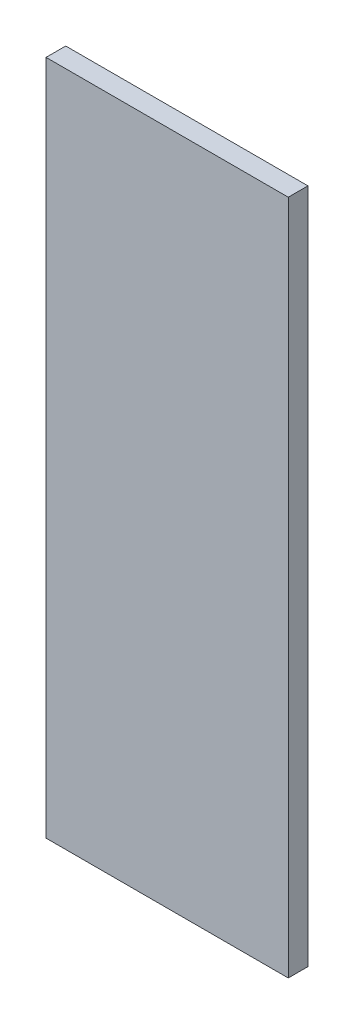
ISO-10303-21;
HEADER;
FILE_DESCRIPTION(('STEP AP214'),'2;1');
FILE_NAME('part.step','',(''),(''),'','','');
FILE_SCHEMA(('AUTOMOTIVE_DESIGN { 1 0 10303 214 1 1 1 1 }'));
ENDSEC;
DATA;
#1=APPLICATION_CONTEXT('core data for automotive mechanical design processes');
#2=APPLICATION_PROTOCOL_DEFINITION('international standard','automotive_design',2000,#1);
#3=PRODUCT_CONTEXT('',#1,'mechanical');
#4=PRODUCT('Part','Part','',(#3));
#5=PRODUCT_RELATED_PRODUCT_CATEGORY('part','',(#4));
#6=PRODUCT_DEFINITION_FORMATION('','',#4);
#7=PRODUCT_DEFINITION_CONTEXT('part definition',#1,'design');
#8=PRODUCT_DEFINITION('design','',#6,#7);
#9=PRODUCT_DEFINITION_SHAPE('','',#8);
#10=(LENGTH_UNIT() NAMED_UNIT(*) SI_UNIT(.MILLI.,.METRE.));
#11=(NAMED_UNIT(*) PLANE_ANGLE_UNIT() SI_UNIT($,.RADIAN.));
#12=(NAMED_UNIT(*) SI_UNIT($,.STERADIAN.) SOLID_ANGLE_UNIT());
#13=UNCERTAINTY_MEASURE_WITH_UNIT(LENGTH_MEASURE(1.E-05),#10,'distance_accuracy_value','');
#14=(GEOMETRIC_REPRESENTATION_CONTEXT(3) GLOBAL_UNCERTAINTY_ASSIGNED_CONTEXT((#13)) GLOBAL_UNIT_ASSIGNED_CONTEXT((#10,
#11,#12)) REPRESENTATION_CONTEXT('',''));
#15=CARTESIAN_POINT('',(0.,0.,0.));
#16=DIRECTION('',(0.,0.,1.));
#17=DIRECTION('',(1.,0.,0.));
#18=AXIS2_PLACEMENT_3D('',#15,#16,#17);
#19=CARTESIAN_POINT('',(-98.5,275.,16.));
#20=DIRECTION('',(0.,1.,0.));
#21=DIRECTION('',(0.,0.,1.));
#22=AXIS2_PLACEMENT_3D('',#19,#20,#21);
#23=PLANE('',#22);
#24=DIRECTION('',(1.,0.,0.));
#25=VECTOR('',#24,1.);
#26=CARTESIAN_POINT('',(-98.5,275.,0.));
#27=LINE('',#26,#25);
#28=CARTESIAN_POINT('',(-98.5,275.,0.));
#29=VERTEX_POINT('',#28);
#30=CARTESIAN_POINT('',(98.5,275.,0.));
#31=VERTEX_POINT('',#30);
#32=EDGE_CURVE('E110',#29,#31,#27,.T.);
#33=ORIENTED_EDGE('',*,*,#32,.F.);
#34=DIRECTION('',(0.,0.,-1.));
#35=VECTOR('',#34,1.);
#36=CARTESIAN_POINT('',(-98.5,275.,16.));
#37=LINE('',#36,#35);
#38=CARTESIAN_POINT('',(-98.5,275.,16.));
#39=VERTEX_POINT('',#38);
#40=EDGE_CURVE('E11',#39,#29,#37,.T.);
#41=ORIENTED_EDGE('',*,*,#40,.F.);
#42=DIRECTION('',(1.,0.,0.));
#43=VECTOR('',#42,1.);
#44=CARTESIAN_POINT('',(-98.5,275.,16.));
#45=LINE('',#44,#43);
#46=CARTESIAN_POINT('',(98.5,275.,16.));
#47=VERTEX_POINT('',#46);
#48=EDGE_CURVE('E103',#39,#47,#45,.T.);
#49=ORIENTED_EDGE('',*,*,#48,.T.);
#50=DIRECTION('',(0.,0.,-1.));
#51=VECTOR('',#50,1.);
#52=CARTESIAN_POINT('',(98.5,275.,16.));
#53=LINE('',#52,#51);
#54=EDGE_CURVE('E42',#47,#31,#53,.T.);
#55=ORIENTED_EDGE('',*,*,#54,.T.);
#56=EDGE_LOOP('',(#33,#41,#49,#55));
#57=FACE_BOUND('',#56,.T.);
#58=ADVANCED_FACE('F39',(#57),#23,.T.);
#59=CARTESIAN_POINT('',(-98.5,275.,16.));
#60=DIRECTION('',(1.,0.,0.));
#61=DIRECTION('',(0.,1.,0.));
#62=AXIS2_PLACEMENT_3D('',#59,#60,#61);
#63=PLANE('',#62);
#64=DIRECTION('',(0.,-1.,0.));
#65=VECTOR('',#64,1.);
#66=CARTESIAN_POINT('',(-98.5,275.,0.));
#67=LINE('',#66,#65);
#68=CARTESIAN_POINT('',(-98.5,-275.,0.));
#69=VERTEX_POINT('',#68);
#70=EDGE_CURVE('E73',#29,#69,#67,.T.);
#71=ORIENTED_EDGE('',*,*,#70,.T.);
#72=DIRECTION('',(0.,0.,-1.));
#73=VECTOR('',#72,1.);
#74=CARTESIAN_POINT('',(-98.5,-275.,16.));
#75=LINE('',#74,#73);
#76=CARTESIAN_POINT('',(-98.5,-275.,16.));
#77=VERTEX_POINT('',#76);
#78=EDGE_CURVE('E49',#77,#69,#75,.T.);
#79=ORIENTED_EDGE('',*,*,#78,.F.);
#80=DIRECTION('',(0.,-1.,0.));
#81=VECTOR('',#80,1.);
#82=CARTESIAN_POINT('',(-98.5,275.,16.));
#83=LINE('',#82,#81);
#84=EDGE_CURVE('E90',#39,#77,#83,.T.);
#85=ORIENTED_EDGE('',*,*,#84,.F.);
#86=ORIENTED_EDGE('',*,*,#40,.T.);
#87=EDGE_LOOP('',(#71,#79,#85,#86));
#88=FACE_BOUND('',#87,.T.);
#89=ADVANCED_FACE('F126',(#88),#63,.F.);
#90=CARTESIAN_POINT('',(-98.5,-275.,16.));
#91=DIRECTION('',(0.,1.,0.));
#92=DIRECTION('',(0.,0.,1.));
#93=AXIS2_PLACEMENT_3D('',#90,#91,#92);
#94=PLANE('',#93);
#95=DIRECTION('',(1.,0.,0.));
#96=VECTOR('',#95,1.);
#97=CARTESIAN_POINT('',(-98.5,-275.,0.));
#98=LINE('',#97,#96);
#99=CARTESIAN_POINT('',(98.5,-275.,0.));
#100=VERTEX_POINT('',#99);
#101=EDGE_CURVE('E98',#69,#100,#98,.T.);
#102=ORIENTED_EDGE('',*,*,#101,.T.);
#103=DIRECTION('',(0.,0.,-1.));
#104=VECTOR('',#103,1.);
#105=CARTESIAN_POINT('',(98.5,-275.,16.));
#106=LINE('',#105,#104);
#107=CARTESIAN_POINT('',(98.5,-275.,16.));
#108=VERTEX_POINT('',#107);
#109=EDGE_CURVE('E95',#108,#100,#106,.T.);
#110=ORIENTED_EDGE('',*,*,#109,.F.);
#111=DIRECTION('',(1.,0.,0.));
#112=VECTOR('',#111,1.);
#113=CARTESIAN_POINT('',(-98.5,-275.,16.));
#114=LINE('',#113,#112);
#115=EDGE_CURVE('E85',#77,#108,#114,.T.);
#116=ORIENTED_EDGE('',*,*,#115,.F.);
#117=ORIENTED_EDGE('',*,*,#78,.T.);
#118=EDGE_LOOP('',(#102,#110,#116,#117));
#119=FACE_BOUND('',#118,.T.);
#120=ADVANCED_FACE('F96',(#119),#94,.F.);
#121=CARTESIAN_POINT('',(98.5,275.,16.));
#122=DIRECTION('',(1.,0.,0.));
#123=DIRECTION('',(0.,1.,0.));
#124=AXIS2_PLACEMENT_3D('',#121,#122,#123);
#125=PLANE('',#124);
#126=DIRECTION('',(0.,-1.,0.));
#127=VECTOR('',#126,1.);
#128=CARTESIAN_POINT('',(98.5,275.,0.));
#129=LINE('',#128,#127);
#130=EDGE_CURVE('E114',#31,#100,#129,.T.);
#131=ORIENTED_EDGE('',*,*,#130,.F.);
#132=ORIENTED_EDGE('',*,*,#54,.F.);
#133=DIRECTION('',(0.,-1.,0.));
#134=VECTOR('',#133,1.);
#135=CARTESIAN_POINT('',(98.5,275.,16.));
#136=LINE('',#135,#134);
#137=EDGE_CURVE('E89',#47,#108,#136,.T.);
#138=ORIENTED_EDGE('',*,*,#137,.T.);
#139=ORIENTED_EDGE('',*,*,#109,.T.);
#140=EDGE_LOOP('',(#131,#132,#138,#139));
#141=FACE_BOUND('',#140,.T.);
#142=ADVANCED_FACE('F101',(#141),#125,.T.);
#143=CARTESIAN_POINT('',(0.,0.,16.));
#144=DIRECTION('',(0.,0.,-1.));
#145=DIRECTION('',(-1.,0.,0.));
#146=AXIS2_PLACEMENT_3D('',#143,#144,#145);
#147=PLANE('',#146);
#148=ORIENTED_EDGE('',*,*,#48,.F.);
#149=ORIENTED_EDGE('',*,*,#84,.T.);
#150=ORIENTED_EDGE('',*,*,#115,.T.);
#151=ORIENTED_EDGE('',*,*,#137,.F.);
#152=EDGE_LOOP('',(#148,#149,#150,#151));
#153=FACE_BOUND('',#152,.T.);
#154=ADVANCED_FACE('F88',(#153),#147,.F.);
#155=CARTESIAN_POINT('',(0.,0.,0.));
#156=DIRECTION('',(0.,0.,-1.));
#157=DIRECTION('',(-1.,0.,0.));
#158=AXIS2_PLACEMENT_3D('',#155,#156,#157);
#159=PLANE('',#158);
#160=ORIENTED_EDGE('',*,*,#32,.T.);
#161=ORIENTED_EDGE('',*,*,#130,.T.);
#162=ORIENTED_EDGE('',*,*,#101,.F.);
#163=ORIENTED_EDGE('',*,*,#70,.F.);
#164=EDGE_LOOP('',(#160,#161,#162,#163));
#165=FACE_BOUND('',#164,.T.);
#166=ADVANCED_FACE('F123',(#165),#159,.T.);
#167=CLOSED_SHELL('',(#58,#89,#120,#142,#154,#166));
#168=MANIFOLD_SOLID_BREP('B2',#167);
#169=ADVANCED_BREP_SHAPE_REPRESENTATION('',(#18,#168),#14);
#170=SHAPE_DEFINITION_REPRESENTATION(#9,#169);
ENDSEC;
END-ISO-10303-21;
